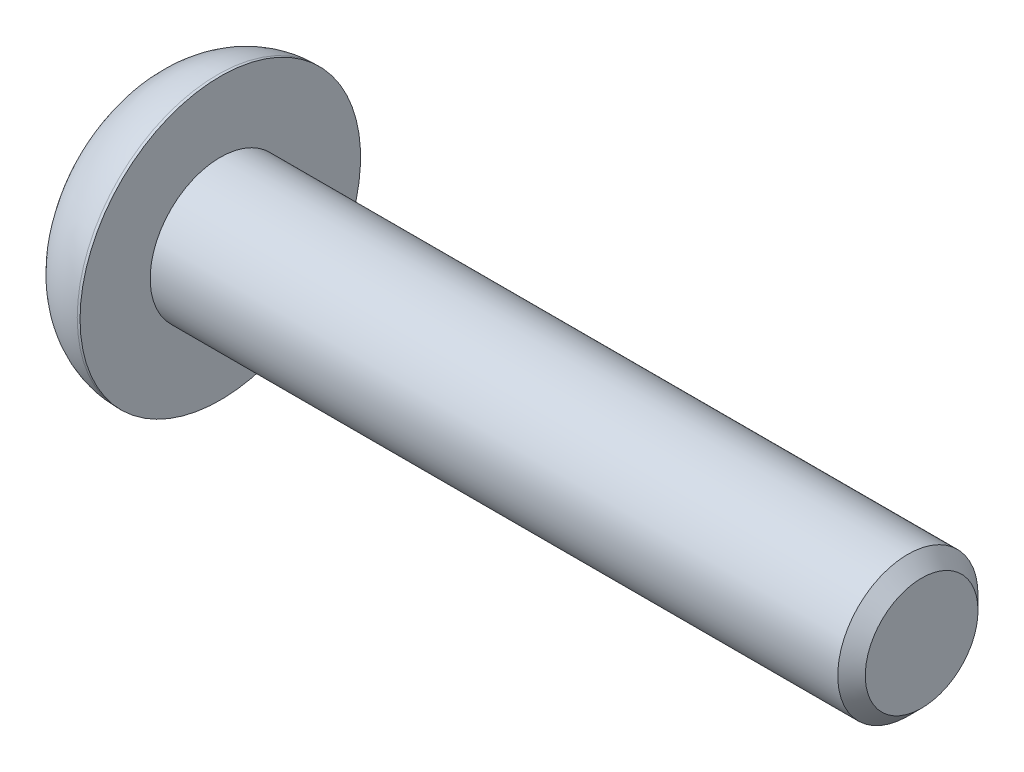
ISO-10303-21;
HEADER;
FILE_DESCRIPTION(('STEP AP214'),'2;1');
FILE_NAME('part.step','',(''),(''),'','','');
FILE_SCHEMA(('AUTOMOTIVE_DESIGN { 1 0 10303 214 1 1 1 1 }'));
ENDSEC;
DATA;
#1=APPLICATION_CONTEXT('core data for automotive mechanical design processes');
#2=APPLICATION_PROTOCOL_DEFINITION('international standard','automotive_design',2000,#1);
#3=PRODUCT_CONTEXT('',#1,'mechanical');
#4=PRODUCT('Part','Part','',(#3));
#5=PRODUCT_RELATED_PRODUCT_CATEGORY('part','',(#4));
#6=PRODUCT_DEFINITION_FORMATION('','',#4);
#7=PRODUCT_DEFINITION_CONTEXT('part definition',#1,'design');
#8=PRODUCT_DEFINITION('design','',#6,#7);
#9=PRODUCT_DEFINITION_SHAPE('','',#8);
#10=(LENGTH_UNIT() NAMED_UNIT(*) SI_UNIT(.MILLI.,.METRE.));
#11=(NAMED_UNIT(*) PLANE_ANGLE_UNIT() SI_UNIT($,.RADIAN.));
#12=(NAMED_UNIT(*) SI_UNIT($,.STERADIAN.) SOLID_ANGLE_UNIT());
#13=UNCERTAINTY_MEASURE_WITH_UNIT(LENGTH_MEASURE(1.E-05),#10,'distance_accuracy_value','');
#14=(GEOMETRIC_REPRESENTATION_CONTEXT(3) GLOBAL_UNCERTAINTY_ASSIGNED_CONTEXT((#13)) GLOBAL_UNIT_ASSIGNED_CONTEXT((#10,
#11,#12)) REPRESENTATION_CONTEXT('',''));
#15=CARTESIAN_POINT('',(0.,0.,0.));
#16=DIRECTION('',(0.,0.,1.));
#17=DIRECTION('',(1.,0.,0.));
#18=AXIS2_PLACEMENT_3D('',#15,#16,#17);
#19=CARTESIAN_POINT('',(1.82,0.,0.));
#20=DIRECTION('',(-1.,0.,0.));
#21=DIRECTION('',(0.,0.,1.));
#22=AXIS2_PLACEMENT_3D('',#19,#20,#21);
#23=PLANE('',#22);
#24=CARTESIAN_POINT('',(1.82,0.,0.));
#25=DIRECTION('',(-1.,0.,0.));
#26=DIRECTION('',(0.,0.,1.));
#27=AXIS2_PLACEMENT_3D('',#24,#25,#26);
#28=CIRCLE('',#27,1.49999999999999);
#29=CARTESIAN_POINT('',(1.82,0.,1.49999999999999));
#30=VERTEX_POINT('',#29);
#31=CARTESIAN_POINT('',(1.82,1.29903810567665,0.749999999999995));
#32=VERTEX_POINT('',#31);
#33=EDGE_CURVE('E129',#30,#32,#28,.T.);
#34=ORIENTED_EDGE('',*,*,#33,.F.);
#35=DIRECTION('',(0.,1.,0.));
#36=VECTOR('',#35,1.);
#37=CARTESIAN_POINT('',(1.82,-0.866025403784438,1.5));
#38=LINE('',#37,#36);
#39=CARTESIAN_POINT('',(1.82,0.866025403784439,1.5));
#40=VERTEX_POINT('',#39);
#41=EDGE_CURVE('E157',#30,#40,#38,.T.);
#42=ORIENTED_EDGE('',*,*,#41,.T.);
#43=DIRECTION('',(0.,0.5,-0.866025403784439));
#44=VECTOR('',#43,1.);
#45=CARTESIAN_POINT('',(1.82,0.866025403784439,1.5));
#46=LINE('',#45,#44);
#47=EDGE_CURVE('E137',#40,#32,#46,.T.);
#48=ORIENTED_EDGE('',*,*,#47,.T.);
#49=EDGE_LOOP('',(#34,#42,#48));
#50=FACE_BOUND('',#49,.T.);
#51=ADVANCED_FACE('F46',(#50),#23,.T.);
#52=CARTESIAN_POINT('',(1.82,1.29903810567665,-0.749999999999994));
#53=VERTEX_POINT('',#52);
#54=EDGE_CURVE('E134',#32,#53,#28,.T.);
#55=ORIENTED_EDGE('',*,*,#54,.F.);
#56=CARTESIAN_POINT('',(1.82,1.73205080756888,0.));
#57=VERTEX_POINT('',#56);
#58=EDGE_CURVE('E141',#32,#57,#46,.T.);
#59=ORIENTED_EDGE('',*,*,#58,.T.);
#60=DIRECTION('',(0.,-0.5,-0.866025403784439));
#61=VECTOR('',#60,1.);
#62=CARTESIAN_POINT('',(1.82,1.73205080756888,0.));
#63=LINE('',#62,#61);
#64=EDGE_CURVE('E142',#57,#53,#63,.T.);
#65=ORIENTED_EDGE('',*,*,#64,.T.);
#66=EDGE_LOOP('',(#55,#59,#65));
#67=FACE_BOUND('',#66,.T.);
#68=ADVANCED_FACE('F213',(#67),#23,.T.);
#69=CARTESIAN_POINT('',(1.82,0.,-1.49999999999999));
#70=VERTEX_POINT('',#69);
#71=EDGE_CURVE('E276',#53,#70,#28,.T.);
#72=ORIENTED_EDGE('',*,*,#71,.F.);
#73=CARTESIAN_POINT('',(1.82,0.866025403784439,-1.5));
#74=VERTEX_POINT('',#73);
#75=EDGE_CURVE('E140',#53,#74,#63,.T.);
#76=ORIENTED_EDGE('',*,*,#75,.T.);
#77=DIRECTION('',(0.,-1.,0.));
#78=VECTOR('',#77,1.);
#79=CARTESIAN_POINT('',(1.82,0.866025403784439,-1.5));
#80=LINE('',#79,#78);
#81=EDGE_CURVE('E146',#74,#70,#80,.T.);
#82=ORIENTED_EDGE('',*,*,#81,.T.);
#83=EDGE_LOOP('',(#72,#76,#82));
#84=FACE_BOUND('',#83,.T.);
#85=ADVANCED_FACE('F219',(#84),#23,.T.);
#86=CARTESIAN_POINT('',(1.82,-1.29903810567665,-0.749999999999995));
#87=VERTEX_POINT('',#86);
#88=EDGE_CURVE('E248',#70,#87,#28,.T.);
#89=ORIENTED_EDGE('',*,*,#88,.F.);
#90=CARTESIAN_POINT('',(1.82,-0.866025403784439,-1.5));
#91=VERTEX_POINT('',#90);
#92=EDGE_CURVE('E145',#70,#91,#80,.T.);
#93=ORIENTED_EDGE('',*,*,#92,.T.);
#94=DIRECTION('',(0.,-0.5,0.866025403784439));
#95=VECTOR('',#94,1.);
#96=CARTESIAN_POINT('',(1.82,-0.866025403784439,-1.5));
#97=LINE('',#96,#95);
#98=EDGE_CURVE('E150',#91,#87,#97,.T.);
#99=ORIENTED_EDGE('',*,*,#98,.T.);
#100=EDGE_LOOP('',(#89,#93,#99));
#101=FACE_BOUND('',#100,.T.);
#102=ADVANCED_FACE('F235',(#101),#23,.T.);
#103=CARTESIAN_POINT('',(1.82,-1.29903810567666,0.75));
#104=VERTEX_POINT('',#103);
#105=EDGE_CURVE('E61',#87,#104,#28,.T.);
#106=ORIENTED_EDGE('',*,*,#105,.F.);
#107=CARTESIAN_POINT('',(1.82,-1.73205080756888,0.));
#108=VERTEX_POINT('',#107);
#109=EDGE_CURVE('E149',#87,#108,#97,.T.);
#110=ORIENTED_EDGE('',*,*,#109,.T.);
#111=DIRECTION('',(0.,0.5,0.866025403784439));
#112=VECTOR('',#111,1.);
#113=CARTESIAN_POINT('',(1.82,-1.73205080756888,0.));
#114=LINE('',#113,#112);
#115=EDGE_CURVE('E154',#108,#104,#114,.T.);
#116=ORIENTED_EDGE('',*,*,#115,.T.);
#117=EDGE_LOOP('',(#106,#110,#116));
#118=FACE_BOUND('',#117,.T.);
#119=ADVANCED_FACE('F226',(#118),#23,.T.);
#120=CARTESIAN_POINT('',(2.8,5.,0.));
#121=DIRECTION('',(1.,0.,0.));
#122=DIRECTION('',(0.,0.,-1.));
#123=AXIS2_PLACEMENT_3D('',#120,#121,#122);
#124=PLANE('',#123);
#125=CARTESIAN_POINT('',(2.8,0.,0.));
#126=DIRECTION('',(-1.,0.,0.));
#127=DIRECTION('',(0.,0.,1.));
#128=AXIS2_PLACEMENT_3D('',#125,#126,#127);
#129=CIRCLE('',#128,5.);
#130=CARTESIAN_POINT('',(2.8,0.,5.));
#131=VERTEX_POINT('',#130);
#132=EDGE_CURVE('E190',#131,#131,#129,.T.);
#133=ORIENTED_EDGE('',*,*,#132,.F.);
#134=EDGE_LOOP('',(#133));
#135=FACE_BOUND('',#134,.T.);
#136=CARTESIAN_POINT('',(2.8,0.,0.));
#137=DIRECTION('',(1.,0.,0.));
#138=DIRECTION('',(0.,0.,-1.));
#139=AXIS2_PLACEMENT_3D('',#136,#137,#138);
#140=CIRCLE('',#139,2.5);
#141=CARTESIAN_POINT('',(2.8,0.,-2.5));
#142=VERTEX_POINT('',#141);
#143=EDGE_CURVE('E178',#142,#142,#140,.T.);
#144=ORIENTED_EDGE('',*,*,#143,.F.);
#145=EDGE_LOOP('',(#144));
#146=FACE_BOUND('',#145,.T.);
#147=ADVANCED_FACE('F234',(#135,#146),#124,.T.);
#148=CARTESIAN_POINT('',(2.8,0.,0.));
#149=DIRECTION('',(-1.,0.,0.));
#150=DIRECTION('',(0.,0.,1.));
#151=AXIS2_PLACEMENT_3D('',#148,#149,#150);
#152=CYLINDRICAL_SURFACE('',#151,5.);
#153=CARTESIAN_POINT('',(2.7,0.,0.));
#154=DIRECTION('',(-1.,0.,0.));
#155=DIRECTION('',(0.,0.,1.));
#156=AXIS2_PLACEMENT_3D('',#153,#154,#155);
#157=CIRCLE('',#156,5.);
#158=CARTESIAN_POINT('',(2.7,0.,5.));
#159=VERTEX_POINT('',#158);
#160=EDGE_CURVE('E13',#159,#159,#157,.F.);
#161=ORIENTED_EDGE('',*,*,#160,.T.);
#162=EDGE_LOOP('',(#161));
#163=FACE_BOUND('',#162,.T.);
#164=ORIENTED_EDGE('',*,*,#132,.T.);
#165=EDGE_LOOP('',(#164));
#166=FACE_BOUND('',#165,.T.);
#167=ADVANCED_FACE('F241',(#163,#166),#152,.T.);
#168=CARTESIAN_POINT('',(0.,0.,0.));
#169=DIRECTION('',(-1.,0.,0.));
#170=DIRECTION('',(0.,0.,1.));
#171=AXIS2_PLACEMENT_3D('',#168,#169,#170);
#172=PLANE('',#171);
#173=CARTESIAN_POINT('',(0.,0.,0.));
#174=DIRECTION('',(-1.,0.,0.));
#175=DIRECTION('',(0.,0.,1.));
#176=AXIS2_PLACEMENT_3D('',#173,#174,#175);
#177=CIRCLE('',#176,2.3);
#178=CARTESIAN_POINT('',(0.,0.,2.3));
#179=VERTEX_POINT('',#178);
#180=EDGE_CURVE('E54',#179,#179,#177,.T.);
#181=ORIENTED_EDGE('',*,*,#180,.T.);
#182=EDGE_LOOP('',(#181));
#183=FACE_BOUND('',#182,.T.);
#184=DIRECTION('',(0.,0.5,-0.866025403784439));
#185=VECTOR('',#184,1.);
#186=CARTESIAN_POINT('',(0.,0.866025403784439,1.5));
#187=LINE('',#186,#185);
#188=CARTESIAN_POINT('',(0.,0.866025403784439,1.5));
#189=VERTEX_POINT('',#188);
#190=CARTESIAN_POINT('',(0.,1.73205080756888,0.));
#191=VERTEX_POINT('',#190);
#192=EDGE_CURVE('E69',#189,#191,#187,.T.);
#193=ORIENTED_EDGE('',*,*,#192,.F.);
#194=DIRECTION('',(0.,1.,0.));
#195=VECTOR('',#194,1.);
#196=CARTESIAN_POINT('',(0.,-0.866025403784438,1.5));
#197=LINE('',#196,#195);
#198=CARTESIAN_POINT('',(0.,-0.866025403784438,1.5));
#199=VERTEX_POINT('',#198);
#200=EDGE_CURVE('E173',#199,#189,#197,.T.);
#201=ORIENTED_EDGE('',*,*,#200,.F.);
#202=DIRECTION('',(0.,0.5,0.866025403784439));
#203=VECTOR('',#202,1.);
#204=CARTESIAN_POINT('',(0.,-1.73205080756888,0.));
#205=LINE('',#204,#203);
#206=CARTESIAN_POINT('',(0.,-1.73205080756888,0.));
#207=VERTEX_POINT('',#206);
#208=EDGE_CURVE('E170',#207,#199,#205,.T.);
#209=ORIENTED_EDGE('',*,*,#208,.F.);
#210=DIRECTION('',(0.,-0.5,0.866025403784439));
#211=VECTOR('',#210,1.);
#212=CARTESIAN_POINT('',(0.,-0.866025403784439,-1.5));
#213=LINE('',#212,#211);
#214=CARTESIAN_POINT('',(0.,-0.866025403784439,-1.5));
#215=VERTEX_POINT('',#214);
#216=EDGE_CURVE('E167',#215,#207,#213,.T.);
#217=ORIENTED_EDGE('',*,*,#216,.F.);
#218=DIRECTION('',(0.,-1.,0.));
#219=VECTOR('',#218,1.);
#220=CARTESIAN_POINT('',(0.,0.866025403784439,-1.5));
#221=LINE('',#220,#219);
#222=CARTESIAN_POINT('',(0.,0.866025403784439,-1.5));
#223=VERTEX_POINT('',#222);
#224=EDGE_CURVE('E164',#223,#215,#221,.T.);
#225=ORIENTED_EDGE('',*,*,#224,.F.);
#226=DIRECTION('',(0.,-0.5,-0.866025403784439));
#227=VECTOR('',#226,1.);
#228=CARTESIAN_POINT('',(0.,1.73205080756888,0.));
#229=LINE('',#228,#227);
#230=EDGE_CURVE('E131',#191,#223,#229,.T.);
#231=ORIENTED_EDGE('',*,*,#230,.F.);
#232=EDGE_LOOP('',(#193,#201,#209,#217,#225,#231));
#233=FACE_BOUND('',#232,.T.);
#234=ADVANCED_FACE('F201',(#183,#233),#172,.T.);
#235=CARTESIAN_POINT('',(27.8,0.,0.));
#236=DIRECTION('',(-1.,0.,0.));
#237=DIRECTION('',(0.,0.,1.));
#238=AXIS2_PLACEMENT_3D('',#235,#236,#237);
#239=CYLINDRICAL_SURFACE('',#238,2.5);
#240=CARTESIAN_POINT('',(27.3094999999577,0.,0.));
#241=DIRECTION('',(1.,0.,0.));
#242=DIRECTION('',(0.,0.,-1.));
#243=AXIS2_PLACEMENT_3D('',#240,#241,#242);
#244=CIRCLE('',#243,2.5);
#245=CARTESIAN_POINT('',(27.3094999999577,0.,-2.5));
#246=VERTEX_POINT('',#245);
#247=EDGE_CURVE('E196',#246,#246,#244,.F.);
#248=ORIENTED_EDGE('',*,*,#247,.T.);
#249=EDGE_LOOP('',(#248));
#250=FACE_BOUND('',#249,.T.);
#251=ORIENTED_EDGE('',*,*,#143,.T.);
#252=EDGE_LOOP('',(#251));
#253=FACE_BOUND('',#252,.T.);
#254=ADVANCED_FACE('F367',(#250,#253),#239,.T.);
#255=CARTESIAN_POINT('',(27.8,0.,0.));
#256=DIRECTION('',(1.,0.,0.));
#257=DIRECTION('',(0.,0.,-1.));
#258=AXIS2_PLACEMENT_3D('',#255,#256,#257);
#259=PLANE('',#258);
#260=CARTESIAN_POINT('',(27.8,0.,0.));
#261=DIRECTION('',(1.,0.,0.));
#262=DIRECTION('',(0.,0.,-1.));
#263=AXIS2_PLACEMENT_3D('',#260,#261,#262);
#264=CIRCLE('',#263,2.00949999995768);
#265=CARTESIAN_POINT('',(27.8,0.,-2.00949999995768));
#266=VERTEX_POINT('',#265);
#267=EDGE_CURVE('E193',#266,#266,#264,.T.);
#268=ORIENTED_EDGE('',*,*,#267,.T.);
#269=EDGE_LOOP('',(#268));
#270=FACE_BOUND('',#269,.T.);
#271=ADVANCED_FACE('F304',(#270),#259,.T.);
#272=CARTESIAN_POINT('',(1.82,0.866025403784439,1.5));
#273=DIRECTION('',(0.,0.866025403784439,0.5));
#274=DIRECTION('',(0.,-0.5,0.866025403784439));
#275=AXIS2_PLACEMENT_3D('',#272,#273,#274);
#276=PLANE('',#275);
#277=ORIENTED_EDGE('',*,*,#192,.T.);
#278=DIRECTION('',(-1.,0.,0.));
#279=VECTOR('',#278,1.);
#280=CARTESIAN_POINT('',(1.82,1.73205080756888,0.));
#281=LINE('',#280,#279);
#282=EDGE_CURVE('E160',#57,#191,#281,.T.);
#283=ORIENTED_EDGE('',*,*,#282,.F.);
#284=ORIENTED_EDGE('',*,*,#58,.F.);
#285=ORIENTED_EDGE('',*,*,#47,.F.);
#286=DIRECTION('',(-1.,0.,0.));
#287=VECTOR('',#286,1.);
#288=CARTESIAN_POINT('',(1.82,0.866025403784439,1.5));
#289=LINE('',#288,#287);
#290=EDGE_CURVE('E176',#40,#189,#289,.T.);
#291=ORIENTED_EDGE('',*,*,#290,.T.);
#292=EDGE_LOOP('',(#277,#283,#284,#285,#291));
#293=FACE_BOUND('',#292,.T.);
#294=ADVANCED_FACE('F273',(#293),#276,.F.);
#295=CARTESIAN_POINT('',(1.82,-0.866025403784438,1.5));
#296=DIRECTION('',(0.,0.,1.));
#297=DIRECTION('',(0.,-1.,0.));
#298=AXIS2_PLACEMENT_3D('',#295,#296,#297);
#299=PLANE('',#298);
#300=ORIENTED_EDGE('',*,*,#200,.T.);
#301=ORIENTED_EDGE('',*,*,#290,.F.);
#302=ORIENTED_EDGE('',*,*,#41,.F.);
#303=CARTESIAN_POINT('',(1.82,-0.866025403784438,1.5));
#304=VERTEX_POINT('',#303);
#305=EDGE_CURVE('E158',#304,#30,#38,.T.);
#306=ORIENTED_EDGE('',*,*,#305,.F.);
#307=DIRECTION('',(-1.,0.,0.));
#308=VECTOR('',#307,1.);
#309=CARTESIAN_POINT('',(1.82,-0.866025403784438,1.5));
#310=LINE('',#309,#308);
#311=EDGE_CURVE('E179',#304,#199,#310,.T.);
#312=ORIENTED_EDGE('',*,*,#311,.T.);
#313=EDGE_LOOP('',(#300,#301,#302,#306,#312));
#314=FACE_BOUND('',#313,.T.);
#315=ADVANCED_FACE('F271',(#314),#299,.F.);
#316=CARTESIAN_POINT('',(1.82,-1.73205080756888,0.));
#317=DIRECTION('',(0.,-0.866025403784439,0.5));
#318=DIRECTION('',(0.,-0.5,-0.866025403784439));
#319=AXIS2_PLACEMENT_3D('',#316,#317,#318);
#320=PLANE('',#319);
#321=ORIENTED_EDGE('',*,*,#208,.T.);
#322=ORIENTED_EDGE('',*,*,#311,.F.);
#323=EDGE_CURVE('E153',#104,#304,#114,.T.);
#324=ORIENTED_EDGE('',*,*,#323,.F.);
#325=ORIENTED_EDGE('',*,*,#115,.F.);
#326=DIRECTION('',(-1.,0.,0.));
#327=VECTOR('',#326,1.);
#328=CARTESIAN_POINT('',(1.82,-1.73205080756888,0.));
#329=LINE('',#328,#327);
#330=EDGE_CURVE('E181',#108,#207,#329,.T.);
#331=ORIENTED_EDGE('',*,*,#330,.T.);
#332=EDGE_LOOP('',(#321,#322,#324,#325,#331));
#333=FACE_BOUND('',#332,.T.);
#334=ADVANCED_FACE('F263',(#333),#320,.F.);
#335=CARTESIAN_POINT('',(1.82,-0.866025403784439,-1.5));
#336=DIRECTION('',(0.,-0.866025403784439,-0.5));
#337=DIRECTION('',(0.,0.5,-0.866025403784439));
#338=AXIS2_PLACEMENT_3D('',#335,#336,#337);
#339=PLANE('',#338);
#340=ORIENTED_EDGE('',*,*,#216,.T.);
#341=ORIENTED_EDGE('',*,*,#330,.F.);
#342=ORIENTED_EDGE('',*,*,#109,.F.);
#343=ORIENTED_EDGE('',*,*,#98,.F.);
#344=DIRECTION('',(-1.,0.,0.));
#345=VECTOR('',#344,1.);
#346=CARTESIAN_POINT('',(1.82,-0.866025403784439,-1.5));
#347=LINE('',#346,#345);
#348=EDGE_CURVE('E183',#91,#215,#347,.T.);
#349=ORIENTED_EDGE('',*,*,#348,.T.);
#350=EDGE_LOOP('',(#340,#341,#342,#343,#349));
#351=FACE_BOUND('',#350,.T.);
#352=ADVANCED_FACE('F251',(#351),#339,.F.);
#353=CARTESIAN_POINT('',(1.82,0.866025403784439,-1.5));
#354=DIRECTION('',(0.,0.,-1.));
#355=DIRECTION('',(-1.,0.,0.));
#356=AXIS2_PLACEMENT_3D('',#353,#354,#355);
#357=PLANE('',#356);
#358=ORIENTED_EDGE('',*,*,#224,.T.);
#359=ORIENTED_EDGE('',*,*,#348,.F.);
#360=ORIENTED_EDGE('',*,*,#92,.F.);
#361=ORIENTED_EDGE('',*,*,#81,.F.);
#362=DIRECTION('',(-1.,0.,0.));
#363=VECTOR('',#362,1.);
#364=CARTESIAN_POINT('',(1.82,0.866025403784439,-1.5));
#365=LINE('',#364,#363);
#366=EDGE_CURVE('E185',#74,#223,#365,.T.);
#367=ORIENTED_EDGE('',*,*,#366,.T.);
#368=EDGE_LOOP('',(#358,#359,#360,#361,#367));
#369=FACE_BOUND('',#368,.T.);
#370=ADVANCED_FACE('F230',(#369),#357,.F.);
#371=CARTESIAN_POINT('',(1.82,1.73205080756888,0.));
#372=DIRECTION('',(0.,0.866025403784439,-0.5));
#373=DIRECTION('',(0.,0.5,0.866025403784439));
#374=AXIS2_PLACEMENT_3D('',#371,#372,#373);
#375=PLANE('',#374);
#376=ORIENTED_EDGE('',*,*,#230,.T.);
#377=ORIENTED_EDGE('',*,*,#366,.F.);
#378=ORIENTED_EDGE('',*,*,#75,.F.);
#379=ORIENTED_EDGE('',*,*,#64,.F.);
#380=ORIENTED_EDGE('',*,*,#282,.T.);
#381=EDGE_LOOP('',(#376,#377,#378,#379,#380));
#382=FACE_BOUND('',#381,.T.);
#383=ADVANCED_FACE('F224',(#382),#375,.F.);
#384=EDGE_CURVE('E135',#104,#30,#28,.T.);
#385=ORIENTED_EDGE('',*,*,#384,.F.);
#386=ORIENTED_EDGE('',*,*,#323,.T.);
#387=ORIENTED_EDGE('',*,*,#305,.T.);
#388=EDGE_LOOP('',(#385,#386,#387));
#389=FACE_BOUND('',#388,.T.);
#390=ADVANCED_FACE('F123',(#389),#23,.T.);
#391=CARTESIAN_POINT('',(1.93397459621557,0.,0.));
#392=DIRECTION('',(-1.,0.,0.));
#393=DIRECTION('',(0.,0.,1.));
#394=AXIS2_PLACEMENT_3D('',#391,#392,#393);
#395=CONICAL_SURFACE('',#394,1.49999999999999,1.04719755119044);
#396=CARTESIAN_POINT('',(2.80000000001231,0.,0.));
#397=VERTEX_POINT('',#396);
#398=VERTEX_LOOP('',#397);
#399=FACE_BOUND('',#398,.T.);
#400=CARTESIAN_POINT('',(1.93397459621557,0.,0.));
#401=DIRECTION('',(-1.,0.,0.));
#402=DIRECTION('',(0.,0.,1.));
#403=AXIS2_PLACEMENT_3D('',#400,#401,#402);
#404=CIRCLE('',#403,1.49999999999999);
#405=CARTESIAN_POINT('',(1.93397459621557,0.,1.49999999999999));
#406=VERTEX_POINT('',#405);
#407=EDGE_CURVE('E127',#406,#406,#404,.T.);
#408=ORIENTED_EDGE('',*,*,#407,.T.);
#409=EDGE_LOOP('',(#408));
#410=FACE_BOUND('',#409,.T.);
#411=ADVANCED_FACE('F119',(#399,#410),#395,.F.);
#412=CARTESIAN_POINT('',(1.82,0.,0.));
#413=DIRECTION('',(-1.,0.,0.));
#414=DIRECTION('',(0.,0.,1.));
#415=AXIS2_PLACEMENT_3D('',#412,#413,#414);
#416=CYLINDRICAL_SURFACE('',#415,1.49999999999999);
#417=ORIENTED_EDGE('',*,*,#407,.F.);
#418=EDGE_LOOP('',(#417));
#419=FACE_BOUND('',#418,.T.);
#420=ORIENTED_EDGE('',*,*,#33,.T.);
#421=ORIENTED_EDGE('',*,*,#54,.T.);
#422=ORIENTED_EDGE('',*,*,#71,.T.);
#423=ORIENTED_EDGE('',*,*,#88,.T.);
#424=ORIENTED_EDGE('',*,*,#105,.T.);
#425=ORIENTED_EDGE('',*,*,#384,.T.);
#426=EDGE_LOOP('',(#420,#421,#422,#423,#424,#425));
#427=FACE_BOUND('',#426,.T.);
#428=ADVANCED_FACE('F122',(#419,#427),#416,.F.);
#429=CARTESIAN_POINT('',(27.8,0.,0.));
#430=DIRECTION('',(-1.,0.,0.));
#431=DIRECTION('',(0.,0.,1.));
#432=AXIS2_PLACEMENT_3D('',#429,#430,#431);
#433=CONICAL_SURFACE('',#432,2.00949999995768,0.785398163397446);
#434=ORIENTED_EDGE('',*,*,#247,.F.);
#435=EDGE_LOOP('',(#434));
#436=FACE_BOUND('',#435,.T.);
#437=ORIENTED_EDGE('',*,*,#267,.F.);
#438=EDGE_LOOP('',(#437));
#439=FACE_BOUND('',#438,.T.);
#440=ADVANCED_FACE('F205',(#436,#439),#433,.T.);
#441=CARTESIAN_POINT('',(2.7,0.,0.));
#442=DIRECTION('',(-1.,0.,0.));
#443=DIRECTION('',(0.,0.,1.));
#444=AXIS2_PLACEMENT_3D('',#441,#442,#443);
#445=DEGENERATE_TOROIDAL_SURFACE('',#444,2.3,2.7,.T.);
#446=ORIENTED_EDGE('',*,*,#160,.F.);
#447=EDGE_LOOP('',(#446));
#448=FACE_BOUND('',#447,.T.);
#449=ORIENTED_EDGE('',*,*,#180,.F.);
#450=EDGE_LOOP('',(#449));
#451=FACE_BOUND('',#450,.T.);
#452=ADVANCED_FACE('F48',(#448,#451),#445,.T.);
#453=CLOSED_SHELL('',(#51,#68,#85,#102,#119,#147,#167,#234,#254,#271,#294,#315,#334,#352,#370,
#383,#390,#411,#428,#440,#452));
#454=MANIFOLD_SOLID_BREP('B2',#453);
#455=ADVANCED_BREP_SHAPE_REPRESENTATION('',(#18,#454),#14);
#456=SHAPE_DEFINITION_REPRESENTATION(#9,#455);
ENDSEC;
END-ISO-10303-21;
